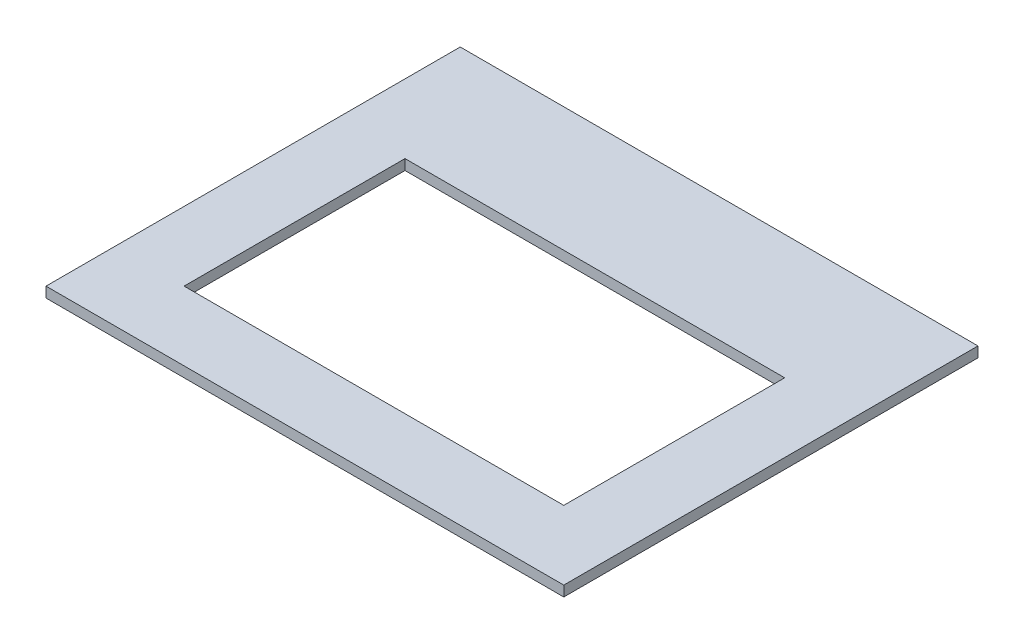
ISO-10303-21;
HEADER;
FILE_DESCRIPTION(('STEP AP214'),'2;1');
FILE_NAME('part.step','',(''),(''),'','','');
FILE_SCHEMA(('AUTOMOTIVE_DESIGN { 1 0 10303 214 1 1 1 1 }'));
ENDSEC;
DATA;
#1=APPLICATION_CONTEXT('core data for automotive mechanical design processes');
#2=APPLICATION_PROTOCOL_DEFINITION('international standard','automotive_design',2000,#1);
#3=PRODUCT_CONTEXT('',#1,'mechanical');
#4=PRODUCT('Part','Part','',(#3));
#5=PRODUCT_RELATED_PRODUCT_CATEGORY('part','',(#4));
#6=PRODUCT_DEFINITION_FORMATION('','',#4);
#7=PRODUCT_DEFINITION_CONTEXT('part definition',#1,'design');
#8=PRODUCT_DEFINITION('design','',#6,#7);
#9=PRODUCT_DEFINITION_SHAPE('','',#8);
#10=(LENGTH_UNIT() NAMED_UNIT(*) SI_UNIT(.MILLI.,.METRE.));
#11=(NAMED_UNIT(*) PLANE_ANGLE_UNIT() SI_UNIT($,.RADIAN.));
#12=(NAMED_UNIT(*) SI_UNIT($,.STERADIAN.) SOLID_ANGLE_UNIT());
#13=UNCERTAINTY_MEASURE_WITH_UNIT(LENGTH_MEASURE(1.E-05),#10,'distance_accuracy_value','');
#14=(GEOMETRIC_REPRESENTATION_CONTEXT(3) GLOBAL_UNCERTAINTY_ASSIGNED_CONTEXT((#13)) GLOBAL_UNIT_ASSIGNED_CONTEXT((#10,
#11,#12)) REPRESENTATION_CONTEXT('',''));
#15=CARTESIAN_POINT('',(0.,0.,0.));
#16=DIRECTION('',(0.,0.,1.));
#17=DIRECTION('',(1.,0.,0.));
#18=AXIS2_PLACEMENT_3D('',#15,#16,#17);
#19=CARTESIAN_POINT('',(0.,3.,120.));
#20=DIRECTION('',(1.,0.,0.));
#21=DIRECTION('',(0.,0.,-1.));
#22=AXIS2_PLACEMENT_3D('',#19,#20,#21);
#23=PLANE('',#22);
#24=DIRECTION('',(0.,0.,1.));
#25=VECTOR('',#24,1.);
#26=CARTESIAN_POINT('',(0.,0.,120.));
#27=LINE('',#26,#25);
#28=CARTESIAN_POINT('',(0.,0.,0.));
#29=VERTEX_POINT('',#28);
#30=CARTESIAN_POINT('',(0.,0.,120.));
#31=VERTEX_POINT('',#30);
#32=EDGE_CURVE('E131',#29,#31,#27,.T.);
#33=ORIENTED_EDGE('',*,*,#32,.T.);
#34=DIRECTION('',(0.,-1.,0.));
#35=VECTOR('',#34,1.);
#36=CARTESIAN_POINT('',(0.,3.,120.));
#37=LINE('',#36,#35);
#38=CARTESIAN_POINT('',(0.,3.,120.));
#39=VERTEX_POINT('',#38);
#40=EDGE_CURVE('E11',#39,#31,#37,.T.);
#41=ORIENTED_EDGE('',*,*,#40,.F.);
#42=DIRECTION('',(0.,0.,1.));
#43=VECTOR('',#42,1.);
#44=CARTESIAN_POINT('',(0.,3.,120.));
#45=LINE('',#44,#43);
#46=CARTESIAN_POINT('',(0.,3.,0.));
#47=VERTEX_POINT('',#46);
#48=EDGE_CURVE('E135',#47,#39,#45,.T.);
#49=ORIENTED_EDGE('',*,*,#48,.F.);
#50=DIRECTION('',(0.,-1.,0.));
#51=VECTOR('',#50,1.);
#52=CARTESIAN_POINT('',(0.,3.,0.));
#53=LINE('',#52,#51);
#54=EDGE_CURVE('E145',#47,#29,#53,.T.);
#55=ORIENTED_EDGE('',*,*,#54,.T.);
#56=EDGE_LOOP('',(#33,#41,#49,#55));
#57=FACE_BOUND('',#56,.T.);
#58=ADVANCED_FACE('F36',(#57),#23,.F.);
#59=CARTESIAN_POINT('',(150.,3.,120.));
#60=DIRECTION('',(0.,0.,-1.));
#61=DIRECTION('',(-1.,0.,0.));
#62=AXIS2_PLACEMENT_3D('',#59,#60,#61);
#63=PLANE('',#62);
#64=DIRECTION('',(1.,0.,0.));
#65=VECTOR('',#64,1.);
#66=CARTESIAN_POINT('',(150.,0.,120.));
#67=LINE('',#66,#65);
#68=CARTESIAN_POINT('',(150.,0.,120.));
#69=VERTEX_POINT('',#68);
#70=EDGE_CURVE('E148',#31,#69,#67,.T.);
#71=ORIENTED_EDGE('',*,*,#70,.T.);
#72=DIRECTION('',(0.,-1.,0.));
#73=VECTOR('',#72,1.);
#74=CARTESIAN_POINT('',(150.,3.,120.));
#75=LINE('',#74,#73);
#76=CARTESIAN_POINT('',(150.,3.,120.));
#77=VERTEX_POINT('',#76);
#78=EDGE_CURVE('E43',#77,#69,#75,.T.);
#79=ORIENTED_EDGE('',*,*,#78,.F.);
#80=DIRECTION('',(1.,0.,0.));
#81=VECTOR('',#80,1.);
#82=CARTESIAN_POINT('',(150.,3.,120.));
#83=LINE('',#82,#81);
#84=EDGE_CURVE('E138',#39,#77,#83,.T.);
#85=ORIENTED_EDGE('',*,*,#84,.F.);
#86=ORIENTED_EDGE('',*,*,#40,.T.);
#87=EDGE_LOOP('',(#71,#79,#85,#86));
#88=FACE_BOUND('',#87,.T.);
#89=ADVANCED_FACE('F176',(#88),#63,.F.);
#90=CARTESIAN_POINT('',(150.,3.,0.));
#91=DIRECTION('',(-1.,0.,0.));
#92=DIRECTION('',(0.,0.,1.));
#93=AXIS2_PLACEMENT_3D('',#90,#91,#92);
#94=PLANE('',#93);
#95=DIRECTION('',(0.,0.,-1.));
#96=VECTOR('',#95,1.);
#97=CARTESIAN_POINT('',(150.,0.,0.));
#98=LINE('',#97,#96);
#99=CARTESIAN_POINT('',(150.,0.,0.));
#100=VERTEX_POINT('',#99);
#101=EDGE_CURVE('E150',#69,#100,#98,.T.);
#102=ORIENTED_EDGE('',*,*,#101,.T.);
#103=DIRECTION('',(0.,-1.,0.));
#104=VECTOR('',#103,1.);
#105=CARTESIAN_POINT('',(150.,3.,0.));
#106=LINE('',#105,#104);
#107=CARTESIAN_POINT('',(150.,3.,0.));
#108=VERTEX_POINT('',#107);
#109=EDGE_CURVE('E155',#108,#100,#106,.T.);
#110=ORIENTED_EDGE('',*,*,#109,.F.);
#111=DIRECTION('',(0.,0.,-1.));
#112=VECTOR('',#111,1.);
#113=CARTESIAN_POINT('',(150.,3.,0.));
#114=LINE('',#113,#112);
#115=EDGE_CURVE('E141',#77,#108,#114,.T.);
#116=ORIENTED_EDGE('',*,*,#115,.F.);
#117=ORIENTED_EDGE('',*,*,#78,.T.);
#118=EDGE_LOOP('',(#102,#110,#116,#117));
#119=FACE_BOUND('',#118,.T.);
#120=ADVANCED_FACE('F162',(#119),#94,.F.);
#121=CARTESIAN_POINT('',(0.,3.,0.));
#122=DIRECTION('',(0.,0.,1.));
#123=DIRECTION('',(1.,0.,0.));
#124=AXIS2_PLACEMENT_3D('',#121,#122,#123);
#125=PLANE('',#124);
#126=DIRECTION('',(-1.,0.,0.));
#127=VECTOR('',#126,1.);
#128=CARTESIAN_POINT('',(0.,0.,0.));
#129=LINE('',#128,#127);
#130=EDGE_CURVE('E139',#100,#29,#129,.T.);
#131=ORIENTED_EDGE('',*,*,#130,.T.);
#132=ORIENTED_EDGE('',*,*,#54,.F.);
#133=DIRECTION('',(-1.,0.,0.));
#134=VECTOR('',#133,1.);
#135=CARTESIAN_POINT('',(0.,3.,0.));
#136=LINE('',#135,#134);
#137=EDGE_CURVE('E143',#108,#47,#136,.T.);
#138=ORIENTED_EDGE('',*,*,#137,.F.);
#139=ORIENTED_EDGE('',*,*,#109,.T.);
#140=EDGE_LOOP('',(#131,#132,#138,#139));
#141=FACE_BOUND('',#140,.T.);
#142=ADVANCED_FACE('F171',(#141),#125,.F.);
#143=CARTESIAN_POINT('',(0.,3.,0.));
#144=DIRECTION('',(0.,-1.,0.));
#145=DIRECTION('',(0.,0.,-1.));
#146=AXIS2_PLACEMENT_3D('',#143,#144,#145);
#147=PLANE('',#146);
#148=DIRECTION('',(1.,0.,0.));
#149=VECTOR('',#148,1.);
#150=CARTESIAN_POINT('',(20.,3.,100.));
#151=LINE('',#150,#149);
#152=CARTESIAN_POINT('',(20.,3.,100.));
#153=VERTEX_POINT('',#152);
#154=CARTESIAN_POINT('',(130.,3.,100.));
#155=VERTEX_POINT('',#154);
#156=EDGE_CURVE('E105',#153,#155,#151,.T.);
#157=ORIENTED_EDGE('',*,*,#156,.F.);
#158=DIRECTION('',(0.,0.,-1.));
#159=VECTOR('',#158,1.);
#160=CARTESIAN_POINT('',(20.,3.,100.));
#161=LINE('',#160,#159);
#162=CARTESIAN_POINT('',(20.,3.,36.));
#163=VERTEX_POINT('',#162);
#164=EDGE_CURVE('E102',#153,#163,#161,.T.);
#165=ORIENTED_EDGE('',*,*,#164,.T.);
#166=DIRECTION('',(1.,0.,0.));
#167=VECTOR('',#166,1.);
#168=CARTESIAN_POINT('',(20.,3.,36.));
#169=LINE('',#168,#167);
#170=CARTESIAN_POINT('',(130.,3.,36.));
#171=VERTEX_POINT('',#170);
#172=EDGE_CURVE('E108',#163,#171,#169,.T.);
#173=ORIENTED_EDGE('',*,*,#172,.T.);
#174=DIRECTION('',(0.,0.,-1.));
#175=VECTOR('',#174,1.);
#176=CARTESIAN_POINT('',(130.,3.,100.));
#177=LINE('',#176,#175);
#178=EDGE_CURVE('E112',#155,#171,#177,.T.);
#179=ORIENTED_EDGE('',*,*,#178,.F.);
#180=EDGE_LOOP('',(#157,#165,#173,#179));
#181=FACE_BOUND('',#180,.T.);
#182=ORIENTED_EDGE('',*,*,#48,.T.);
#183=ORIENTED_EDGE('',*,*,#84,.T.);
#184=ORIENTED_EDGE('',*,*,#115,.T.);
#185=ORIENTED_EDGE('',*,*,#137,.T.);
#186=EDGE_LOOP('',(#182,#183,#184,#185));
#187=FACE_BOUND('',#186,.T.);
#188=ADVANCED_FACE('F114',(#181,#187),#147,.F.);
#189=CARTESIAN_POINT('',(0.,0.,0.));
#190=DIRECTION('',(0.,-1.,0.));
#191=DIRECTION('',(0.,0.,-1.));
#192=AXIS2_PLACEMENT_3D('',#189,#190,#191);
#193=PLANE('',#192);
#194=DIRECTION('',(0.,0.,-1.));
#195=VECTOR('',#194,1.);
#196=CARTESIAN_POINT('',(20.,0.,100.));
#197=LINE('',#196,#195);
#198=CARTESIAN_POINT('',(20.,0.,100.));
#199=VERTEX_POINT('',#198);
#200=CARTESIAN_POINT('',(20.,0.,36.));
#201=VERTEX_POINT('',#200);
#202=EDGE_CURVE('E58',#199,#201,#197,.T.);
#203=ORIENTED_EDGE('',*,*,#202,.F.);
#204=DIRECTION('',(1.,0.,0.));
#205=VECTOR('',#204,1.);
#206=CARTESIAN_POINT('',(20.,0.,100.));
#207=LINE('',#206,#205);
#208=CARTESIAN_POINT('',(130.,0.,100.));
#209=VERTEX_POINT('',#208);
#210=EDGE_CURVE('E116',#199,#209,#207,.T.);
#211=ORIENTED_EDGE('',*,*,#210,.T.);
#212=DIRECTION('',(0.,0.,-1.));
#213=VECTOR('',#212,1.);
#214=CARTESIAN_POINT('',(130.,0.,100.));
#215=LINE('',#214,#213);
#216=CARTESIAN_POINT('',(130.,0.,36.));
#217=VERTEX_POINT('',#216);
#218=EDGE_CURVE('E119',#209,#217,#215,.T.);
#219=ORIENTED_EDGE('',*,*,#218,.T.);
#220=DIRECTION('',(1.,0.,0.));
#221=VECTOR('',#220,1.);
#222=CARTESIAN_POINT('',(20.,0.,36.));
#223=LINE('',#222,#221);
#224=EDGE_CURVE('E125',#201,#217,#223,.T.);
#225=ORIENTED_EDGE('',*,*,#224,.F.);
#226=EDGE_LOOP('',(#203,#211,#219,#225));
#227=FACE_BOUND('',#226,.T.);
#228=ORIENTED_EDGE('',*,*,#32,.F.);
#229=ORIENTED_EDGE('',*,*,#130,.F.);
#230=ORIENTED_EDGE('',*,*,#101,.F.);
#231=ORIENTED_EDGE('',*,*,#70,.F.);
#232=EDGE_LOOP('',(#228,#229,#230,#231));
#233=FACE_BOUND('',#232,.T.);
#234=ADVANCED_FACE('F168',(#227,#233),#193,.T.);
#235=CARTESIAN_POINT('',(20.,3.,100.));
#236=DIRECTION('',(-1.,0.,0.));
#237=DIRECTION('',(0.,0.,1.));
#238=AXIS2_PLACEMENT_3D('',#235,#236,#237);
#239=PLANE('',#238);
#240=ORIENTED_EDGE('',*,*,#202,.T.);
#241=DIRECTION('',(0.,-1.,0.));
#242=VECTOR('',#241,1.);
#243=CARTESIAN_POINT('',(20.,3.,36.));
#244=LINE('',#243,#242);
#245=EDGE_CURVE('E99',#163,#201,#244,.T.);
#246=ORIENTED_EDGE('',*,*,#245,.F.);
#247=ORIENTED_EDGE('',*,*,#164,.F.);
#248=DIRECTION('',(0.,-1.,0.));
#249=VECTOR('',#248,1.);
#250=CARTESIAN_POINT('',(20.,3.,100.));
#251=LINE('',#250,#249);
#252=EDGE_CURVE('E129',#153,#199,#251,.T.);
#253=ORIENTED_EDGE('',*,*,#252,.T.);
#254=EDGE_LOOP('',(#240,#246,#247,#253));
#255=FACE_BOUND('',#254,.T.);
#256=ADVANCED_FACE('F100',(#255),#239,.F.);
#257=CARTESIAN_POINT('',(20.,3.,100.));
#258=DIRECTION('',(0.,0.,-1.));
#259=DIRECTION('',(-1.,0.,0.));
#260=AXIS2_PLACEMENT_3D('',#257,#258,#259);
#261=PLANE('',#260);
#262=ORIENTED_EDGE('',*,*,#210,.F.);
#263=ORIENTED_EDGE('',*,*,#252,.F.);
#264=ORIENTED_EDGE('',*,*,#156,.T.);
#265=DIRECTION('',(0.,-1.,0.));
#266=VECTOR('',#265,1.);
#267=CARTESIAN_POINT('',(130.,3.,100.));
#268=LINE('',#267,#266);
#269=EDGE_CURVE('E132',#155,#209,#268,.T.);
#270=ORIENTED_EDGE('',*,*,#269,.T.);
#271=EDGE_LOOP('',(#262,#263,#264,#270));
#272=FACE_BOUND('',#271,.T.);
#273=ADVANCED_FACE('F193',(#272),#261,.T.);
#274=CARTESIAN_POINT('',(130.,3.,100.));
#275=DIRECTION('',(-1.,0.,0.));
#276=DIRECTION('',(0.,0.,1.));
#277=AXIS2_PLACEMENT_3D('',#274,#275,#276);
#278=PLANE('',#277);
#279=ORIENTED_EDGE('',*,*,#218,.F.);
#280=ORIENTED_EDGE('',*,*,#269,.F.);
#281=ORIENTED_EDGE('',*,*,#178,.T.);
#282=DIRECTION('',(0.,-1.,0.));
#283=VECTOR('',#282,1.);
#284=CARTESIAN_POINT('',(130.,3.,36.));
#285=LINE('',#284,#283);
#286=EDGE_CURVE('E50',#171,#217,#285,.T.);
#287=ORIENTED_EDGE('',*,*,#286,.T.);
#288=EDGE_LOOP('',(#279,#280,#281,#287));
#289=FACE_BOUND('',#288,.T.);
#290=ADVANCED_FACE('F196',(#289),#278,.T.);
#291=CARTESIAN_POINT('',(20.,3.,36.));
#292=DIRECTION('',(0.,0.,-1.));
#293=DIRECTION('',(-1.,0.,0.));
#294=AXIS2_PLACEMENT_3D('',#291,#292,#293);
#295=PLANE('',#294);
#296=ORIENTED_EDGE('',*,*,#224,.T.);
#297=ORIENTED_EDGE('',*,*,#286,.F.);
#298=ORIENTED_EDGE('',*,*,#172,.F.);
#299=ORIENTED_EDGE('',*,*,#245,.T.);
#300=EDGE_LOOP('',(#296,#297,#298,#299));
#301=FACE_BOUND('',#300,.T.);
#302=ADVANCED_FACE('F109',(#301),#295,.F.);
#303=CLOSED_SHELL('',(#58,#89,#120,#142,#188,#234,#256,#273,#290,#302));
#304=MANIFOLD_SOLID_BREP('B2',#303);
#305=ADVANCED_BREP_SHAPE_REPRESENTATION('',(#18,#304),#14);
#306=SHAPE_DEFINITION_REPRESENTATION(#9,#305);
ENDSEC;
END-ISO-10303-21;
